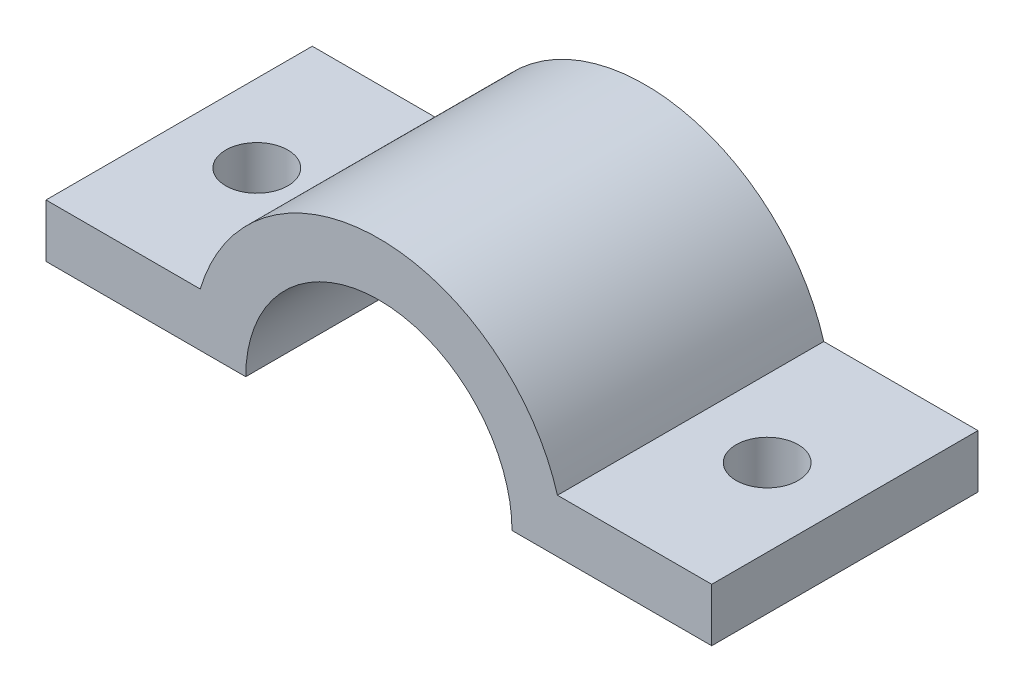
ISO-10303-21;
HEADER;
FILE_DESCRIPTION(('STEP AP214'),'2;1');
FILE_NAME('part.step','',(''),(''),'','','');
FILE_SCHEMA(('AUTOMOTIVE_DESIGN { 1 0 10303 214 1 1 1 1 }'));
ENDSEC;
DATA;
#1=APPLICATION_CONTEXT('core data for automotive mechanical design processes');
#2=APPLICATION_PROTOCOL_DEFINITION('international standard','automotive_design',2000,#1);
#3=PRODUCT_CONTEXT('',#1,'mechanical');
#4=PRODUCT('Part','Part','',(#3));
#5=PRODUCT_RELATED_PRODUCT_CATEGORY('part','',(#4));
#6=PRODUCT_DEFINITION_FORMATION('','',#4);
#7=PRODUCT_DEFINITION_CONTEXT('part definition',#1,'design');
#8=PRODUCT_DEFINITION('design','',#6,#7);
#9=PRODUCT_DEFINITION_SHAPE('','',#8);
#10=(LENGTH_UNIT() NAMED_UNIT(*) SI_UNIT(.MILLI.,.METRE.));
#11=(NAMED_UNIT(*) PLANE_ANGLE_UNIT() SI_UNIT($,.RADIAN.));
#12=(NAMED_UNIT(*) SI_UNIT($,.STERADIAN.) SOLID_ANGLE_UNIT());
#13=UNCERTAINTY_MEASURE_WITH_UNIT(LENGTH_MEASURE(1.E-05),#10,'distance_accuracy_value','');
#14=(GEOMETRIC_REPRESENTATION_CONTEXT(3) GLOBAL_UNCERTAINTY_ASSIGNED_CONTEXT((#13)) GLOBAL_UNIT_ASSIGNED_CONTEXT((#10,
#11,#12)) REPRESENTATION_CONTEXT('',''));
#15=CARTESIAN_POINT('',(0.,0.,0.));
#16=DIRECTION('',(0.,0.,1.));
#17=DIRECTION('',(1.,0.,0.));
#18=AXIS2_PLACEMENT_3D('',#15,#16,#17);
#19=CARTESIAN_POINT('',(0.,0.,15.));
#20=DIRECTION('',(0.,0.,-1.));
#21=DIRECTION('',(-1.,0.,0.));
#22=AXIS2_PLACEMENT_3D('',#19,#20,#21);
#23=CYLINDRICAL_SURFACE('',#22,15.);
#24=CARTESIAN_POINT('',(0.,0.,-15.));
#25=DIRECTION('',(0.,0.,-1.));
#26=DIRECTION('',(1.,0.,0.));
#27=AXIS2_PLACEMENT_3D('',#24,#25,#26);
#28=CIRCLE('',#27,15.);
#29=CARTESIAN_POINT('',(-15.,0.,-15.));
#30=VERTEX_POINT('',#29);
#31=CARTESIAN_POINT('',(15.,0.,-15.));
#32=VERTEX_POINT('',#31);
#33=EDGE_CURVE('E130',#30,#32,#28,.T.);
#34=ORIENTED_EDGE('',*,*,#33,.T.);
#35=DIRECTION('',(0.,0.,-1.));
#36=VECTOR('',#35,1.);
#37=CARTESIAN_POINT('',(15.,0.,15.));
#38=LINE('',#37,#36);
#39=CARTESIAN_POINT('',(15.,0.,15.));
#40=VERTEX_POINT('',#39);
#41=EDGE_CURVE('E11',#40,#32,#38,.T.);
#42=ORIENTED_EDGE('',*,*,#41,.F.);
#43=CARTESIAN_POINT('',(0.,0.,15.));
#44=DIRECTION('',(0.,0.,-1.));
#45=DIRECTION('',(1.,0.,0.));
#46=AXIS2_PLACEMENT_3D('',#43,#44,#45);
#47=CIRCLE('',#46,15.);
#48=CARTESIAN_POINT('',(-15.,0.,15.));
#49=VERTEX_POINT('',#48);
#50=EDGE_CURVE('E145',#49,#40,#47,.T.);
#51=ORIENTED_EDGE('',*,*,#50,.F.);
#52=DIRECTION('',(0.,0.,-1.));
#53=VECTOR('',#52,1.);
#54=CARTESIAN_POINT('',(-15.,0.,15.));
#55=LINE('',#54,#53);
#56=EDGE_CURVE('E126',#49,#30,#55,.T.);
#57=ORIENTED_EDGE('',*,*,#56,.T.);
#58=EDGE_LOOP('',(#34,#42,#51,#57));
#59=FACE_BOUND('',#58,.T.);
#60=ADVANCED_FACE('F34',(#59),#23,.F.);
#61=CARTESIAN_POINT('',(15.,0.,15.));
#62=DIRECTION('',(0.,1.,0.));
#63=DIRECTION('',(-1.,0.,0.));
#64=AXIS2_PLACEMENT_3D('',#61,#62,#63);
#65=PLANE('',#64);
#66=CARTESIAN_POINT('',(28.75,0.,0.));
#67=DIRECTION('',(0.,1.,0.));
#68=DIRECTION('',(0.,0.,1.));
#69=AXIS2_PLACEMENT_3D('',#66,#67,#68);
#70=CIRCLE('',#69,3.5);
#71=CARTESIAN_POINT('',(28.75,0.,3.5));
#72=VERTEX_POINT('',#71);
#73=EDGE_CURVE('E134',#72,#72,#70,.T.);
#74=ORIENTED_EDGE('',*,*,#73,.T.);
#75=EDGE_LOOP('',(#74));
#76=FACE_BOUND('',#75,.T.);
#77=DIRECTION('',(1.,0.,0.));
#78=VECTOR('',#77,1.);
#79=CARTESIAN_POINT('',(15.,0.,-15.));
#80=LINE('',#79,#78);
#81=CARTESIAN_POINT('',(37.5,0.,-15.));
#82=VERTEX_POINT('',#81);
#83=EDGE_CURVE('E133',#32,#82,#80,.T.);
#84=ORIENTED_EDGE('',*,*,#83,.T.);
#85=DIRECTION('',(0.,0.,-1.));
#86=VECTOR('',#85,1.);
#87=CARTESIAN_POINT('',(37.5,0.,15.));
#88=LINE('',#87,#86);
#89=CARTESIAN_POINT('',(37.5,0.,15.));
#90=VERTEX_POINT('',#89);
#91=EDGE_CURVE('E42',#90,#82,#88,.T.);
#92=ORIENTED_EDGE('',*,*,#91,.F.);
#93=DIRECTION('',(1.,0.,0.));
#94=VECTOR('',#93,1.);
#95=CARTESIAN_POINT('',(15.,0.,15.));
#96=LINE('',#95,#94);
#97=EDGE_CURVE('E93',#40,#90,#96,.T.);
#98=ORIENTED_EDGE('',*,*,#97,.F.);
#99=ORIENTED_EDGE('',*,*,#41,.T.);
#100=EDGE_LOOP('',(#84,#92,#98,#99));
#101=FACE_BOUND('',#100,.T.);
#102=ADVANCED_FACE('F202',(#76,#101),#65,.F.);
#103=CARTESIAN_POINT('',(37.5,0.,15.));
#104=DIRECTION('',(-1.,0.,0.));
#105=DIRECTION('',(0.,0.,1.));
#106=AXIS2_PLACEMENT_3D('',#103,#104,#105);
#107=PLANE('',#106);
#108=DIRECTION('',(0.,1.,0.));
#109=VECTOR('',#108,1.);
#110=CARTESIAN_POINT('',(37.5,0.,-15.));
#111=LINE('',#110,#109);
#112=CARTESIAN_POINT('',(37.5,6.,-15.));
#113=VERTEX_POINT('',#112);
#114=EDGE_CURVE('E136',#82,#113,#111,.T.);
#115=ORIENTED_EDGE('',*,*,#114,.T.);
#116=DIRECTION('',(0.,0.,-1.));
#117=VECTOR('',#116,1.);
#118=CARTESIAN_POINT('',(37.5,6.,15.));
#119=LINE('',#118,#117);
#120=CARTESIAN_POINT('',(37.5,6.,15.));
#121=VERTEX_POINT('',#120);
#122=EDGE_CURVE('E152',#121,#113,#119,.T.);
#123=ORIENTED_EDGE('',*,*,#122,.F.);
#124=DIRECTION('',(0.,1.,0.));
#125=VECTOR('',#124,1.);
#126=CARTESIAN_POINT('',(37.5,0.,15.));
#127=LINE('',#126,#125);
#128=EDGE_CURVE('E160',#90,#121,#127,.T.);
#129=ORIENTED_EDGE('',*,*,#128,.F.);
#130=ORIENTED_EDGE('',*,*,#91,.T.);
#131=EDGE_LOOP('',(#115,#123,#129,#130));
#132=FACE_BOUND('',#131,.T.);
#133=ADVANCED_FACE('F158',(#132),#107,.F.);
#134=CARTESIAN_POINT('',(37.5,6.,15.));
#135=DIRECTION('',(0.,-1.,0.));
#136=DIRECTION('',(1.,0.,0.));
#137=AXIS2_PLACEMENT_3D('',#134,#135,#136);
#138=PLANE('',#137);
#139=CARTESIAN_POINT('',(28.75,5.99999999999999,0.));
#140=DIRECTION('',(0.,1.,0.));
#141=DIRECTION('',(0.,0.,1.));
#142=AXIS2_PLACEMENT_3D('',#139,#140,#141);
#143=CIRCLE('',#142,3.49999999999999);
#144=CARTESIAN_POINT('',(28.75,5.99999999999999,3.49999999999999));
#145=VERTEX_POINT('',#144);
#146=EDGE_CURVE('E180',#145,#145,#143,.T.);
#147=ORIENTED_EDGE('',*,*,#146,.F.);
#148=EDGE_LOOP('',(#147));
#149=FACE_BOUND('',#148,.T.);
#150=DIRECTION('',(-1.,0.,0.));
#151=VECTOR('',#150,1.);
#152=CARTESIAN_POINT('',(37.5,6.,-15.));
#153=LINE('',#152,#151);
#154=CARTESIAN_POINT('',(20.1246117974981,6.,-15.));
#155=VERTEX_POINT('',#154);
#156=EDGE_CURVE('E138',#113,#155,#153,.T.);
#157=ORIENTED_EDGE('',*,*,#156,.T.);
#158=DIRECTION('',(0.,0.,-1.));
#159=VECTOR('',#158,1.);
#160=CARTESIAN_POINT('',(20.1246117974981,6.,15.));
#161=LINE('',#160,#159);
#162=CARTESIAN_POINT('',(20.1246117974981,6.,15.));
#163=VERTEX_POINT('',#162);
#164=EDGE_CURVE('E149',#163,#155,#161,.T.);
#165=ORIENTED_EDGE('',*,*,#164,.F.);
#166=DIRECTION('',(-1.,0.,0.));
#167=VECTOR('',#166,1.);
#168=CARTESIAN_POINT('',(37.5,6.,15.));
#169=LINE('',#168,#167);
#170=EDGE_CURVE('E172',#121,#163,#169,.T.);
#171=ORIENTED_EDGE('',*,*,#170,.F.);
#172=ORIENTED_EDGE('',*,*,#122,.T.);
#173=EDGE_LOOP('',(#157,#165,#171,#172));
#174=FACE_BOUND('',#173,.T.);
#175=ADVANCED_FACE('F168',(#149,#174),#138,.F.);
#176=CARTESIAN_POINT('',(0.,0.,15.));
#177=DIRECTION('',(0.,0.,-1.));
#178=DIRECTION('',(-1.,0.,0.));
#179=AXIS2_PLACEMENT_3D('',#176,#177,#178);
#180=CYLINDRICAL_SURFACE('',#179,21.);
#181=CARTESIAN_POINT('',(0.,0.,-15.));
#182=DIRECTION('',(0.,0.,1.));
#183=DIRECTION('',(1.,0.,0.));
#184=AXIS2_PLACEMENT_3D('',#181,#182,#183);
#185=CIRCLE('',#184,21.);
#186=CARTESIAN_POINT('',(-20.1246117974981,5.99999999999998,-15.));
#187=VERTEX_POINT('',#186);
#188=EDGE_CURVE('E140',#155,#187,#185,.T.);
#189=ORIENTED_EDGE('',*,*,#188,.T.);
#190=DIRECTION('',(0.,0.,-1.));
#191=VECTOR('',#190,1.);
#192=CARTESIAN_POINT('',(-20.1246117974981,5.99999999999998,15.));
#193=LINE('',#192,#191);
#194=CARTESIAN_POINT('',(-20.1246117974981,5.99999999999998,15.));
#195=VERTEX_POINT('',#194);
#196=EDGE_CURVE('E121',#195,#187,#193,.T.);
#197=ORIENTED_EDGE('',*,*,#196,.F.);
#198=CARTESIAN_POINT('',(0.,0.,15.));
#199=DIRECTION('',(0.,0.,1.));
#200=DIRECTION('',(1.,0.,0.));
#201=AXIS2_PLACEMENT_3D('',#198,#199,#200);
#202=CIRCLE('',#201,21.);
#203=EDGE_CURVE('E112',#163,#195,#202,.T.);
#204=ORIENTED_EDGE('',*,*,#203,.F.);
#205=ORIENTED_EDGE('',*,*,#164,.T.);
#206=EDGE_LOOP('',(#189,#197,#204,#205));
#207=FACE_BOUND('',#206,.T.);
#208=ADVANCED_FACE('F171',(#207),#180,.T.);
#209=CARTESIAN_POINT('',(-37.5,5.99999999999998,15.));
#210=DIRECTION('',(0.,-1.,0.));
#211=DIRECTION('',(0.,0.,-1.));
#212=AXIS2_PLACEMENT_3D('',#209,#210,#211);
#213=PLANE('',#212);
#214=CARTESIAN_POINT('',(-28.75,5.99999999999999,0.));
#215=DIRECTION('',(0.,1.,0.));
#216=DIRECTION('',(0.,0.,1.));
#217=AXIS2_PLACEMENT_3D('',#214,#215,#216);
#218=CIRCLE('',#217,3.49999999999999);
#219=CARTESIAN_POINT('',(-28.75,5.99999999999999,3.49999999999999));
#220=VERTEX_POINT('',#219);
#221=EDGE_CURVE('E186',#220,#220,#218,.T.);
#222=ORIENTED_EDGE('',*,*,#221,.F.);
#223=EDGE_LOOP('',(#222));
#224=FACE_BOUND('',#223,.T.);
#225=DIRECTION('',(-1.,0.,0.));
#226=VECTOR('',#225,1.);
#227=CARTESIAN_POINT('',(-37.5,5.99999999999998,-15.));
#228=LINE('',#227,#226);
#229=CARTESIAN_POINT('',(-37.5,5.99999999999998,-15.));
#230=VERTEX_POINT('',#229);
#231=EDGE_CURVE('E120',#187,#230,#228,.T.);
#232=ORIENTED_EDGE('',*,*,#231,.T.);
#233=DIRECTION('',(0.,0.,-1.));
#234=VECTOR('',#233,1.);
#235=CARTESIAN_POINT('',(-37.5,5.99999999999998,15.));
#236=LINE('',#235,#234);
#237=CARTESIAN_POINT('',(-37.5,5.99999999999998,15.));
#238=VERTEX_POINT('',#237);
#239=EDGE_CURVE('E117',#238,#230,#236,.T.);
#240=ORIENTED_EDGE('',*,*,#239,.F.);
#241=DIRECTION('',(-1.,0.,0.));
#242=VECTOR('',#241,1.);
#243=CARTESIAN_POINT('',(-37.5,5.99999999999998,15.));
#244=LINE('',#243,#242);
#245=EDGE_CURVE('E106',#195,#238,#244,.T.);
#246=ORIENTED_EDGE('',*,*,#245,.F.);
#247=ORIENTED_EDGE('',*,*,#196,.T.);
#248=EDGE_LOOP('',(#232,#240,#246,#247));
#249=FACE_BOUND('',#248,.T.);
#250=ADVANCED_FACE('F118',(#224,#249),#213,.F.);
#251=CARTESIAN_POINT('',(-37.5,0.,15.));
#252=DIRECTION('',(1.,0.,0.));
#253=DIRECTION('',(0.,0.,-1.));
#254=AXIS2_PLACEMENT_3D('',#251,#252,#253);
#255=PLANE('',#254);
#256=DIRECTION('',(0.,-1.,0.));
#257=VECTOR('',#256,1.);
#258=CARTESIAN_POINT('',(-37.5,0.,-15.));
#259=LINE('',#258,#257);
#260=CARTESIAN_POINT('',(-37.5,0.,-15.));
#261=VERTEX_POINT('',#260);
#262=EDGE_CURVE('E79',#230,#261,#259,.T.);
#263=ORIENTED_EDGE('',*,*,#262,.T.);
#264=DIRECTION('',(0.,0.,-1.));
#265=VECTOR('',#264,1.);
#266=CARTESIAN_POINT('',(-37.5,0.,15.));
#267=LINE('',#266,#265);
#268=CARTESIAN_POINT('',(-37.5,0.,15.));
#269=VERTEX_POINT('',#268);
#270=EDGE_CURVE('E122',#269,#261,#267,.T.);
#271=ORIENTED_EDGE('',*,*,#270,.F.);
#272=DIRECTION('',(0.,-1.,0.));
#273=VECTOR('',#272,1.);
#274=CARTESIAN_POINT('',(-37.5,0.,15.));
#275=LINE('',#274,#273);
#276=EDGE_CURVE('E110',#238,#269,#275,.T.);
#277=ORIENTED_EDGE('',*,*,#276,.F.);
#278=ORIENTED_EDGE('',*,*,#239,.T.);
#279=EDGE_LOOP('',(#263,#271,#277,#278));
#280=FACE_BOUND('',#279,.T.);
#281=ADVANCED_FACE('F124',(#280),#255,.F.);
#282=CARTESIAN_POINT('',(-15.,0.,15.));
#283=DIRECTION('',(0.,1.,0.));
#284=DIRECTION('',(-1.,0.,0.));
#285=AXIS2_PLACEMENT_3D('',#282,#283,#284);
#286=PLANE('',#285);
#287=CARTESIAN_POINT('',(-28.75,0.,0.));
#288=DIRECTION('',(0.,1.,0.));
#289=DIRECTION('',(0.,0.,1.));
#290=AXIS2_PLACEMENT_3D('',#287,#288,#289);
#291=CIRCLE('',#290,3.5);
#292=CARTESIAN_POINT('',(-28.75,0.,3.5));
#293=VERTEX_POINT('',#292);
#294=EDGE_CURVE('E183',#293,#293,#291,.T.);
#295=ORIENTED_EDGE('',*,*,#294,.T.);
#296=EDGE_LOOP('',(#295));
#297=FACE_BOUND('',#296,.T.);
#298=DIRECTION('',(1.,0.,0.));
#299=VECTOR('',#298,1.);
#300=CARTESIAN_POINT('',(-15.,0.,-15.));
#301=LINE('',#300,#299);
#302=EDGE_CURVE('E85',#261,#30,#301,.T.);
#303=ORIENTED_EDGE('',*,*,#302,.T.);
#304=ORIENTED_EDGE('',*,*,#56,.F.);
#305=DIRECTION('',(1.,0.,0.));
#306=VECTOR('',#305,1.);
#307=CARTESIAN_POINT('',(-15.,0.,15.));
#308=LINE('',#307,#306);
#309=EDGE_CURVE('E50',#269,#49,#308,.T.);
#310=ORIENTED_EDGE('',*,*,#309,.F.);
#311=ORIENTED_EDGE('',*,*,#270,.T.);
#312=EDGE_LOOP('',(#303,#304,#310,#311));
#313=FACE_BOUND('',#312,.T.);
#314=ADVANCED_FACE('F198',(#297,#313),#286,.F.);
#315=CARTESIAN_POINT('',(0.,0.,15.));
#316=DIRECTION('',(0.,0.,1.));
#317=DIRECTION('',(1.,0.,0.));
#318=AXIS2_PLACEMENT_3D('',#315,#316,#317);
#319=PLANE('',#318);
#320=ORIENTED_EDGE('',*,*,#50,.T.);
#321=ORIENTED_EDGE('',*,*,#97,.T.);
#322=ORIENTED_EDGE('',*,*,#128,.T.);
#323=ORIENTED_EDGE('',*,*,#170,.T.);
#324=ORIENTED_EDGE('',*,*,#203,.T.);
#325=ORIENTED_EDGE('',*,*,#245,.T.);
#326=ORIENTED_EDGE('',*,*,#276,.T.);
#327=ORIENTED_EDGE('',*,*,#309,.T.);
#328=EDGE_LOOP('',(#320,#321,#322,#323,#324,#325,#326,#327));
#329=FACE_BOUND('',#328,.T.);
#330=ADVANCED_FACE('F108',(#329),#319,.T.);
#331=CARTESIAN_POINT('',(0.,0.,-15.));
#332=DIRECTION('',(0.,0.,1.));
#333=DIRECTION('',(1.,0.,0.));
#334=AXIS2_PLACEMENT_3D('',#331,#332,#333);
#335=PLANE('',#334);
#336=ORIENTED_EDGE('',*,*,#33,.F.);
#337=ORIENTED_EDGE('',*,*,#302,.F.);
#338=ORIENTED_EDGE('',*,*,#262,.F.);
#339=ORIENTED_EDGE('',*,*,#231,.F.);
#340=ORIENTED_EDGE('',*,*,#188,.F.);
#341=ORIENTED_EDGE('',*,*,#156,.F.);
#342=ORIENTED_EDGE('',*,*,#114,.F.);
#343=ORIENTED_EDGE('',*,*,#83,.F.);
#344=EDGE_LOOP('',(#336,#337,#338,#339,#340,#341,#342,#343));
#345=FACE_BOUND('',#344,.T.);
#346=ADVANCED_FACE('F164',(#345),#335,.F.);
#347=CARTESIAN_POINT('',(28.75,5.99999999999998,0.));
#348=DIRECTION('',(0.,1.,0.));
#349=DIRECTION('',(0.,0.,1.));
#350=AXIS2_PLACEMENT_3D('',#347,#348,#349);
#351=CYLINDRICAL_SURFACE('',#350,3.49999999999999);
#352=ORIENTED_EDGE('',*,*,#73,.F.);
#353=EDGE_LOOP('',(#352));
#354=FACE_BOUND('',#353,.T.);
#355=ORIENTED_EDGE('',*,*,#146,.T.);
#356=EDGE_LOOP('',(#355));
#357=FACE_BOUND('',#356,.T.);
#358=ADVANCED_FACE('F219',(#354,#357),#351,.F.);
#359=CARTESIAN_POINT('',(-28.75,5.99999999999998,0.));
#360=DIRECTION('',(0.,1.,0.));
#361=DIRECTION('',(0.,0.,1.));
#362=AXIS2_PLACEMENT_3D('',#359,#360,#361);
#363=CYLINDRICAL_SURFACE('',#362,3.49999999999999);
#364=ORIENTED_EDGE('',*,*,#294,.F.);
#365=EDGE_LOOP('',(#364));
#366=FACE_BOUND('',#365,.T.);
#367=ORIENTED_EDGE('',*,*,#221,.T.);
#368=EDGE_LOOP('',(#367));
#369=FACE_BOUND('',#368,.T.);
#370=ADVANCED_FACE('F190',(#366,#369),#363,.F.);
#371=CLOSED_SHELL('',(#60,#102,#133,#175,#208,#250,#281,#314,#330,#346,#358,#370));
#372=MANIFOLD_SOLID_BREP('B2',#371);
#373=ADVANCED_BREP_SHAPE_REPRESENTATION('',(#18,#372),#14);
#374=SHAPE_DEFINITION_REPRESENTATION(#9,#373);
ENDSEC;
END-ISO-10303-21;
